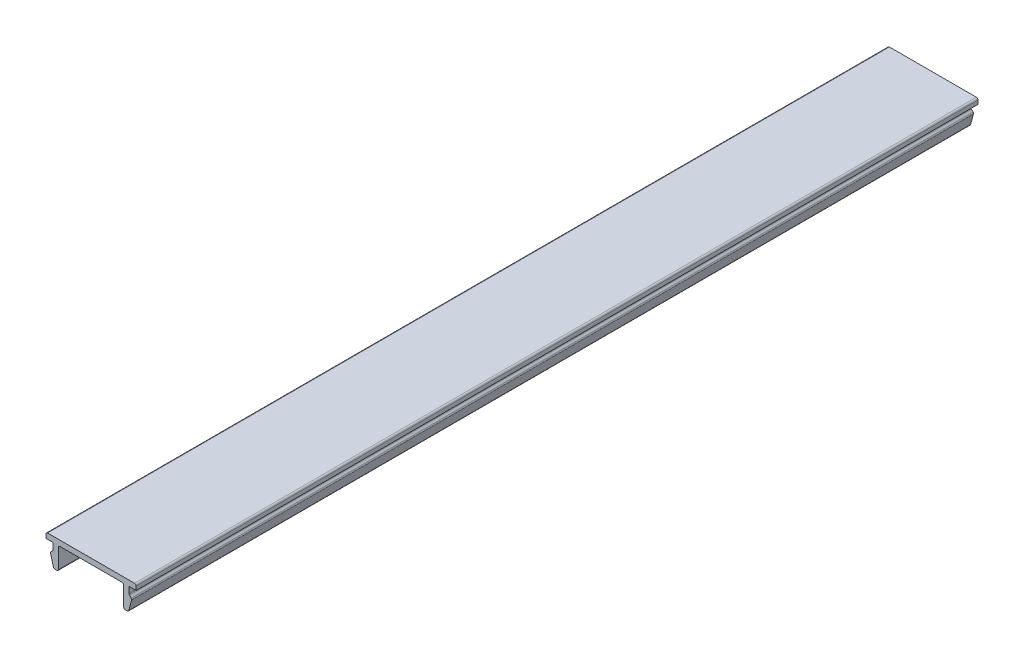
ISO-10303-21;
HEADER;
FILE_DESCRIPTION(('STEP AP214'),'2;1');
FILE_NAME('part.step','',(''),(''),'','','');
FILE_SCHEMA(('AUTOMOTIVE_DESIGN { 1 0 10303 214 1 1 1 1 }'));
ENDSEC;
DATA;
#1=APPLICATION_CONTEXT('core data for automotive mechanical design processes');
#2=APPLICATION_PROTOCOL_DEFINITION('international standard','automotive_design',2000,#1);
#3=PRODUCT_CONTEXT('',#1,'mechanical');
#4=PRODUCT('Part','Part','',(#3));
#5=PRODUCT_RELATED_PRODUCT_CATEGORY('part','',(#4));
#6=PRODUCT_DEFINITION_FORMATION('','',#4);
#7=PRODUCT_DEFINITION_CONTEXT('part definition',#1,'design');
#8=PRODUCT_DEFINITION('design','',#6,#7);
#9=PRODUCT_DEFINITION_SHAPE('','',#8);
#10=(LENGTH_UNIT() NAMED_UNIT(*) SI_UNIT(.MILLI.,.METRE.));
#11=(NAMED_UNIT(*) PLANE_ANGLE_UNIT() SI_UNIT($,.RADIAN.));
#12=(NAMED_UNIT(*) SI_UNIT($,.STERADIAN.) SOLID_ANGLE_UNIT());
#13=UNCERTAINTY_MEASURE_WITH_UNIT(LENGTH_MEASURE(1.E-05),#10,'distance_accuracy_value','');
#14=(GEOMETRIC_REPRESENTATION_CONTEXT(3) GLOBAL_UNCERTAINTY_ASSIGNED_CONTEXT((#13)) GLOBAL_UNIT_ASSIGNED_CONTEXT((#10,
#11,#12)) REPRESENTATION_CONTEXT('',''));
#15=CARTESIAN_POINT('',(0.,0.,0.));
#16=DIRECTION('',(0.,0.,1.));
#17=DIRECTION('',(1.,0.,0.));
#18=AXIS2_PLACEMENT_3D('',#15,#16,#17);
#19=CARTESIAN_POINT('',(-8.3,1.,155.));
#20=DIRECTION('',(1.,0.,0.));
#21=DIRECTION('',(0.,0.,-1.));
#22=AXIS2_PLACEMENT_3D('',#19,#20,#21);
#23=PLANE('',#22);
#24=DIRECTION('',(0.,-1.,0.));
#25=VECTOR('',#24,1.);
#26=CARTESIAN_POINT('',(-8.3,1.,155.));
#27=LINE('',#26,#25);
#28=CARTESIAN_POINT('',(-8.3,0.7,155.));
#29=VERTEX_POINT('',#28);
#30=CARTESIAN_POINT('',(-8.3,0.,155.));
#31=VERTEX_POINT('',#30);
#32=EDGE_CURVE('E224',#29,#31,#27,.T.);
#33=ORIENTED_EDGE('',*,*,#32,.F.);
#34=DIRECTION('',(0.,0.,-1.));
#35=VECTOR('',#34,1.);
#36=CARTESIAN_POINT('',(-8.3,0.7,155.));
#37=LINE('',#36,#35);
#38=CARTESIAN_POINT('',(-8.3,0.7,0.));
#39=VERTEX_POINT('',#38);
#40=EDGE_CURVE('E387',#29,#39,#37,.T.);
#41=ORIENTED_EDGE('',*,*,#40,.T.);
#42=DIRECTION('',(0.,-1.,0.));
#43=VECTOR('',#42,1.);
#44=CARTESIAN_POINT('',(-8.3,1.,0.));
#45=LINE('',#44,#43);
#46=CARTESIAN_POINT('',(-8.3,0.,0.));
#47=VERTEX_POINT('',#46);
#48=EDGE_CURVE('E252',#39,#47,#45,.T.);
#49=ORIENTED_EDGE('',*,*,#48,.T.);
#50=DIRECTION('',(0.,0.,-1.));
#51=VECTOR('',#50,1.);
#52=CARTESIAN_POINT('',(-8.3,0.,155.));
#53=LINE('',#52,#51);
#54=EDGE_CURVE('E244',#31,#47,#53,.T.);
#55=ORIENTED_EDGE('',*,*,#54,.F.);
#56=EDGE_LOOP('',(#33,#41,#49,#55));
#57=FACE_BOUND('',#56,.T.);
#58=ADVANCED_FACE('F39',(#57),#23,.F.);
#59=CARTESIAN_POINT('',(-8.3,0.,155.));
#60=DIRECTION('',(0.,1.,0.));
#61=DIRECTION('',(0.,0.,1.));
#62=AXIS2_PLACEMENT_3D('',#59,#60,#61);
#63=PLANE('',#62);
#64=DIRECTION('',(1.,0.,0.));
#65=VECTOR('',#64,1.);
#66=CARTESIAN_POINT('',(-8.3,0.,0.));
#67=LINE('',#66,#65);
#68=CARTESIAN_POINT('',(-7.,0.,0.));
#69=VERTEX_POINT('',#68);
#70=EDGE_CURVE('E422',#47,#69,#67,.T.);
#71=ORIENTED_EDGE('',*,*,#70,.T.);
#72=DIRECTION('',(0.,0.,-1.));
#73=VECTOR('',#72,1.);
#74=CARTESIAN_POINT('',(-7.,0.,155.));
#75=LINE('',#74,#73);
#76=CARTESIAN_POINT('',(-7.,0.,155.));
#77=VERTEX_POINT('',#76);
#78=EDGE_CURVE('E246',#77,#69,#75,.T.);
#79=ORIENTED_EDGE('',*,*,#78,.F.);
#80=DIRECTION('',(1.,0.,0.));
#81=VECTOR('',#80,1.);
#82=CARTESIAN_POINT('',(-8.3,0.,155.));
#83=LINE('',#82,#81);
#84=EDGE_CURVE('E229',#31,#77,#83,.T.);
#85=ORIENTED_EDGE('',*,*,#84,.F.);
#86=ORIENTED_EDGE('',*,*,#54,.T.);
#87=EDGE_LOOP('',(#71,#79,#85,#86));
#88=FACE_BOUND('',#87,.T.);
#89=ADVANCED_FACE('F243',(#88),#63,.F.);
#90=CARTESIAN_POINT('',(-7.,0.,155.));
#91=DIRECTION('',(1.,0.,0.));
#92=DIRECTION('',(0.,0.,-1.));
#93=AXIS2_PLACEMENT_3D('',#90,#91,#92);
#94=PLANE('',#93);
#95=DIRECTION('',(0.,-1.,0.));
#96=VECTOR('',#95,1.);
#97=CARTESIAN_POINT('',(-7.,0.,0.));
#98=LINE('',#97,#96);
#99=CARTESIAN_POINT('',(-7.,-1.17573593128807,0.));
#100=VERTEX_POINT('',#99);
#101=EDGE_CURVE('E413',#69,#100,#98,.T.);
#102=ORIENTED_EDGE('',*,*,#101,.T.);
#103=DIRECTION('',(0.,0.,-1.));
#104=VECTOR('',#103,1.);
#105=CARTESIAN_POINT('',(-7.,-1.17573593128807,155.));
#106=LINE('',#105,#104);
#107=CARTESIAN_POINT('',(-7.,-1.17573593128807,155.));
#108=VERTEX_POINT('',#107);
#109=EDGE_CURVE('E384',#100,#108,#106,.F.);
#110=ORIENTED_EDGE('',*,*,#109,.T.);
#111=DIRECTION('',(0.,-1.,0.));
#112=VECTOR('',#111,1.);
#113=CARTESIAN_POINT('',(-7.,0.,155.));
#114=LINE('',#113,#112);
#115=EDGE_CURVE('E249',#77,#108,#114,.T.);
#116=ORIENTED_EDGE('',*,*,#115,.F.);
#117=ORIENTED_EDGE('',*,*,#78,.T.);
#118=EDGE_LOOP('',(#102,#110,#116,#117));
#119=FACE_BOUND('',#118,.T.);
#120=ADVANCED_FACE('F420',(#119),#94,.F.);
#121=CARTESIAN_POINT('',(-7.,-1.3,155.));
#122=DIRECTION('',(0.707106781186547,-0.707106781186548,0.));
#123=DIRECTION('',(0.707106781186548,0.707106781186547,0.));
#124=AXIS2_PLACEMENT_3D('',#121,#122,#123);
#125=PLANE('',#124);
#126=DIRECTION('',(-0.707106781186548,-0.707106781186547,0.));
#127=VECTOR('',#126,1.);
#128=CARTESIAN_POINT('',(-7.,-1.3,0.));
#129=LINE('',#128,#127);
#130=CARTESIAN_POINT('',(-7.08786796564404,-1.38786796564404,0.));
#131=VERTEX_POINT('',#130);
#132=CARTESIAN_POINT('',(-7.37752551286084,-1.67752551286084,0.));
#133=VERTEX_POINT('',#132);
#134=EDGE_CURVE('E415',#131,#133,#129,.T.);
#135=ORIENTED_EDGE('',*,*,#134,.T.);
#136=DIRECTION('',(0.,0.,-1.));
#137=VECTOR('',#136,1.);
#138=CARTESIAN_POINT('',(-7.37752551286084,-1.67752551286084,155.));
#139=LINE('',#138,#137);
#140=CARTESIAN_POINT('',(-7.37752551286084,-1.67752551286084,155.));
#141=VERTEX_POINT('',#140);
#142=EDGE_CURVE('E381',#133,#141,#139,.F.);
#143=ORIENTED_EDGE('',*,*,#142,.T.);
#144=DIRECTION('',(-0.707106781186548,-0.707106781186547,0.));
#145=VECTOR('',#144,1.);
#146=CARTESIAN_POINT('',(-7.,-1.3,155.));
#147=LINE('',#146,#145);
#148=CARTESIAN_POINT('',(-7.08786796564404,-1.38786796564404,155.));
#149=VERTEX_POINT('',#148);
#150=EDGE_CURVE('E428',#149,#141,#147,.T.);
#151=ORIENTED_EDGE('',*,*,#150,.F.);
#152=DIRECTION('',(0.,0.,-1.));
#153=VECTOR('',#152,1.);
#154=CARTESIAN_POINT('',(-7.08786796564404,-1.38786796564404,0.));
#155=LINE('',#154,#153);
#156=EDGE_CURVE('E377',#149,#131,#155,.T.);
#157=ORIENTED_EDGE('',*,*,#156,.T.);
#158=EDGE_LOOP('',(#135,#143,#151,#157));
#159=FACE_BOUND('',#158,.T.);
#160=ADVANCED_FACE('F431',(#159),#125,.F.);
#161=CARTESIAN_POINT('',(-7.5,-1.8,155.));
#162=DIRECTION('',(0.965925826289068,0.258819045102522,0.));
#163=DIRECTION('',(-0.258819045102522,0.965925826289068,0.));
#164=AXIS2_PLACEMENT_3D('',#161,#162,#163);
#165=PLANE('',#164);
#166=DIRECTION('',(0.258819045102522,-0.965925826289068,0.));
#167=VECTOR('',#166,1.);
#168=CARTESIAN_POINT('',(-7.5,-1.8,0.));
#169=LINE('',#168,#167);
#170=CARTESIAN_POINT('',(-7.4551712263916,-1.96730326074756,0.));
#171=VERTEX_POINT('',#170);
#172=CARTESIAN_POINT('',(-6.94329650890145,-3.87764571353076,0.));
#173=VERTEX_POINT('',#172);
#174=EDGE_CURVE('E488',#171,#173,#169,.T.);
#175=ORIENTED_EDGE('',*,*,#174,.T.);
#176=DIRECTION('',(0.,0.,-1.));
#177=VECTOR('',#176,1.);
#178=CARTESIAN_POINT('',(-6.94329650890145,-3.87764571353076,155.));
#179=LINE('',#178,#177);
#180=CARTESIAN_POINT('',(-6.94329650890145,-3.87764571353076,155.));
#181=VERTEX_POINT('',#180);
#182=EDGE_CURVE('E374',#173,#181,#179,.F.);
#183=ORIENTED_EDGE('',*,*,#182,.T.);
#184=DIRECTION('',(0.258819045102522,-0.965925826289068,0.));
#185=VECTOR('',#184,1.);
#186=CARTESIAN_POINT('',(-7.5,-1.8,155.));
#187=LINE('',#186,#185);
#188=CARTESIAN_POINT('',(-7.4551712263916,-1.96730326074756,155.));
#189=VERTEX_POINT('',#188);
#190=EDGE_CURVE('E434',#189,#181,#187,.T.);
#191=ORIENTED_EDGE('',*,*,#190,.F.);
#192=DIRECTION('',(0.,0.,-1.));
#193=VECTOR('',#192,1.);
#194=CARTESIAN_POINT('',(-7.4551712263916,-1.96730326074756,155.));
#195=LINE('',#194,#193);
#196=EDGE_CURVE('E370',#189,#171,#195,.T.);
#197=ORIENTED_EDGE('',*,*,#196,.T.);
#198=EDGE_LOOP('',(#175,#183,#191,#197));
#199=FACE_BOUND('',#198,.T.);
#200=ADVANCED_FACE('F613',(#199),#165,.F.);
#201=CARTESIAN_POINT('',(-6.,-4.1,155.));
#202=DIRECTION('',(0.,1.,0.));
#203=DIRECTION('',(0.,0.,1.));
#204=AXIS2_PLACEMENT_3D('',#201,#202,#203);
#205=PLANE('',#204);
#206=DIRECTION('',(1.,0.,0.));
#207=VECTOR('',#206,1.);
#208=CARTESIAN_POINT('',(-6.,-4.1,0.));
#209=LINE('',#208,#207);
#210=CARTESIAN_POINT('',(-6.65351876101473,-4.1,0.));
#211=VERTEX_POINT('',#210);
#212=CARTESIAN_POINT('',(-6.3,-4.1,0.));
#213=VERTEX_POINT('',#212);
#214=EDGE_CURVE('E492',#211,#213,#209,.T.);
#215=ORIENTED_EDGE('',*,*,#214,.T.);
#216=DIRECTION('',(0.,0.,-1.));
#217=VECTOR('',#216,1.);
#218=CARTESIAN_POINT('',(-6.3,-4.1,155.));
#219=LINE('',#218,#217);
#220=CARTESIAN_POINT('',(-6.3,-4.1,155.));
#221=VERTEX_POINT('',#220);
#222=EDGE_CURVE('E367',#213,#221,#219,.F.);
#223=ORIENTED_EDGE('',*,*,#222,.T.);
#224=DIRECTION('',(1.,0.,0.));
#225=VECTOR('',#224,1.);
#226=CARTESIAN_POINT('',(-6.,-4.1,155.));
#227=LINE('',#226,#225);
#228=CARTESIAN_POINT('',(-6.65351876101473,-4.1,155.));
#229=VERTEX_POINT('',#228);
#230=EDGE_CURVE('E439',#229,#221,#227,.T.);
#231=ORIENTED_EDGE('',*,*,#230,.F.);
#232=DIRECTION('',(0.,0.,-1.));
#233=VECTOR('',#232,1.);
#234=CARTESIAN_POINT('',(-6.65351876101473,-4.1,155.));
#235=LINE('',#234,#233);
#236=EDGE_CURVE('E363',#229,#211,#235,.T.);
#237=ORIENTED_EDGE('',*,*,#236,.T.);
#238=EDGE_LOOP('',(#215,#223,#231,#237));
#239=FACE_BOUND('',#238,.T.);
#240=ADVANCED_FACE('F620',(#239),#205,.F.);
#241=CARTESIAN_POINT('',(-6.,0.,155.));
#242=DIRECTION('',(-1.,0.,0.));
#243=DIRECTION('',(0.,-1.,0.));
#244=AXIS2_PLACEMENT_3D('',#241,#242,#243);
#245=PLANE('',#244);
#246=DIRECTION('',(0.,1.,0.));
#247=VECTOR('',#246,1.);
#248=CARTESIAN_POINT('',(-6.,0.,0.));
#249=LINE('',#248,#247);
#250=CARTESIAN_POINT('',(-6.,-3.8,0.));
#251=VERTEX_POINT('',#250);
#252=CARTESIAN_POINT('',(-6.,-0.3,0.));
#253=VERTEX_POINT('',#252);
#254=EDGE_CURVE('E496',#251,#253,#249,.T.);
#255=ORIENTED_EDGE('',*,*,#254,.T.);
#256=DIRECTION('',(0.,0.,-1.));
#257=VECTOR('',#256,1.);
#258=CARTESIAN_POINT('',(-6.,-0.3,155.));
#259=LINE('',#258,#257);
#260=CARTESIAN_POINT('',(-6.,-0.3,155.));
#261=VERTEX_POINT('',#260);
#262=EDGE_CURVE('E360',#253,#261,#259,.F.);
#263=ORIENTED_EDGE('',*,*,#262,.T.);
#264=DIRECTION('',(0.,1.,0.));
#265=VECTOR('',#264,1.);
#266=CARTESIAN_POINT('',(-6.,0.,155.));
#267=LINE('',#266,#265);
#268=CARTESIAN_POINT('',(-6.,-3.8,155.));
#269=VERTEX_POINT('',#268);
#270=EDGE_CURVE('E446',#269,#261,#267,.T.);
#271=ORIENTED_EDGE('',*,*,#270,.F.);
#272=DIRECTION('',(0.,0.,-1.));
#273=VECTOR('',#272,1.);
#274=CARTESIAN_POINT('',(-6.,-3.8,155.));
#275=LINE('',#274,#273);
#276=EDGE_CURVE('E356',#269,#251,#275,.T.);
#277=ORIENTED_EDGE('',*,*,#276,.T.);
#278=EDGE_LOOP('',(#255,#263,#271,#277));
#279=FACE_BOUND('',#278,.T.);
#280=ADVANCED_FACE('F627',(#279),#245,.F.);
#281=CARTESIAN_POINT('',(-6.,0.,155.));
#282=DIRECTION('',(0.,1.,0.));
#283=DIRECTION('',(0.,0.,1.));
#284=AXIS2_PLACEMENT_3D('',#281,#282,#283);
#285=PLANE('',#284);
#286=DIRECTION('',(1.,0.,0.));
#287=VECTOR('',#286,1.);
#288=CARTESIAN_POINT('',(-6.,0.,0.));
#289=LINE('',#288,#287);
#290=CARTESIAN_POINT('',(-5.7,0.,0.));
#291=VERTEX_POINT('',#290);
#292=CARTESIAN_POINT('',(5.69999999999999,0.,0.));
#293=VERTEX_POINT('',#292);
#294=EDGE_CURVE('E500',#291,#293,#289,.T.);
#295=ORIENTED_EDGE('',*,*,#294,.T.);
#296=DIRECTION('',(0.,0.,-1.));
#297=VECTOR('',#296,1.);
#298=CARTESIAN_POINT('',(5.69999999999999,0.,155.));
#299=LINE('',#298,#297);
#300=CARTESIAN_POINT('',(5.69999999999999,0.,155.));
#301=VERTEX_POINT('',#300);
#302=EDGE_CURVE('E353',#293,#301,#299,.F.);
#303=ORIENTED_EDGE('',*,*,#302,.T.);
#304=DIRECTION('',(1.,0.,0.));
#305=VECTOR('',#304,1.);
#306=CARTESIAN_POINT('',(-6.,0.,155.));
#307=LINE('',#306,#305);
#308=CARTESIAN_POINT('',(-5.7,0.,155.));
#309=VERTEX_POINT('',#308);
#310=EDGE_CURVE('E450',#309,#301,#307,.T.);
#311=ORIENTED_EDGE('',*,*,#310,.F.);
#312=DIRECTION('',(0.,0.,-1.));
#313=VECTOR('',#312,1.);
#314=CARTESIAN_POINT('',(-5.7,0.,0.));
#315=LINE('',#314,#313);
#316=EDGE_CURVE('E349',#309,#291,#315,.T.);
#317=ORIENTED_EDGE('',*,*,#316,.T.);
#318=EDGE_LOOP('',(#295,#303,#311,#317));
#319=FACE_BOUND('',#318,.T.);
#320=ADVANCED_FACE('F634',(#319),#285,.F.);
#321=CARTESIAN_POINT('',(5.99999999999999,0.,155.));
#322=DIRECTION('',(1.,0.,0.));
#323=DIRECTION('',(0.,1.,0.));
#324=AXIS2_PLACEMENT_3D('',#321,#322,#323);
#325=PLANE('',#324);
#326=DIRECTION('',(0.,-1.,0.));
#327=VECTOR('',#326,1.);
#328=CARTESIAN_POINT('',(5.99999999999999,0.,0.));
#329=LINE('',#328,#327);
#330=CARTESIAN_POINT('',(5.99999999999999,-0.3,0.));
#331=VERTEX_POINT('',#330);
#332=CARTESIAN_POINT('',(5.99999999999999,-3.8,0.));
#333=VERTEX_POINT('',#332);
#334=EDGE_CURVE('E504',#331,#333,#329,.T.);
#335=ORIENTED_EDGE('',*,*,#334,.T.);
#336=DIRECTION('',(0.,0.,-1.));
#337=VECTOR('',#336,1.);
#338=CARTESIAN_POINT('',(5.99999999999999,-3.8,155.));
#339=LINE('',#338,#337);
#340=CARTESIAN_POINT('',(5.99999999999999,-3.8,155.));
#341=VERTEX_POINT('',#340);
#342=EDGE_CURVE('E346',#333,#341,#339,.F.);
#343=ORIENTED_EDGE('',*,*,#342,.T.);
#344=DIRECTION('',(0.,-1.,0.));
#345=VECTOR('',#344,1.);
#346=CARTESIAN_POINT('',(5.99999999999999,0.,155.));
#347=LINE('',#346,#345);
#348=CARTESIAN_POINT('',(5.99999999999999,-0.3,155.));
#349=VERTEX_POINT('',#348);
#350=EDGE_CURVE('E454',#349,#341,#347,.T.);
#351=ORIENTED_EDGE('',*,*,#350,.F.);
#352=DIRECTION('',(0.,0.,-1.));
#353=VECTOR('',#352,1.);
#354=CARTESIAN_POINT('',(5.99999999999999,-0.3,0.));
#355=LINE('',#354,#353);
#356=EDGE_CURVE('E342',#349,#331,#355,.T.);
#357=ORIENTED_EDGE('',*,*,#356,.T.);
#358=EDGE_LOOP('',(#335,#343,#351,#357));
#359=FACE_BOUND('',#358,.T.);
#360=ADVANCED_FACE('F641',(#359),#325,.F.);
#361=CARTESIAN_POINT('',(5.99999999999999,-4.1,155.));
#362=DIRECTION('',(0.,1.,0.));
#363=DIRECTION('',(0.,0.,1.));
#364=AXIS2_PLACEMENT_3D('',#361,#362,#363);
#365=PLANE('',#364);
#366=DIRECTION('',(1.,0.,0.));
#367=VECTOR('',#366,1.);
#368=CARTESIAN_POINT('',(5.99999999999999,-4.1,0.));
#369=LINE('',#368,#367);
#370=CARTESIAN_POINT('',(6.29999999999999,-4.1,0.));
#371=VERTEX_POINT('',#370);
#372=CARTESIAN_POINT('',(6.65351876101472,-4.1,0.));
#373=VERTEX_POINT('',#372);
#374=EDGE_CURVE('E508',#371,#373,#369,.T.);
#375=ORIENTED_EDGE('',*,*,#374,.T.);
#376=DIRECTION('',(0.,0.,-1.));
#377=VECTOR('',#376,1.);
#378=CARTESIAN_POINT('',(6.65351876101472,-4.1,155.));
#379=LINE('',#378,#377);
#380=CARTESIAN_POINT('',(6.65351876101472,-4.1,155.));
#381=VERTEX_POINT('',#380);
#382=EDGE_CURVE('E339',#373,#381,#379,.F.);
#383=ORIENTED_EDGE('',*,*,#382,.T.);
#384=DIRECTION('',(1.,0.,0.));
#385=VECTOR('',#384,1.);
#386=CARTESIAN_POINT('',(5.99999999999999,-4.1,155.));
#387=LINE('',#386,#385);
#388=CARTESIAN_POINT('',(6.29999999999999,-4.1,155.));
#389=VERTEX_POINT('',#388);
#390=EDGE_CURVE('E458',#389,#381,#387,.T.);
#391=ORIENTED_EDGE('',*,*,#390,.F.);
#392=DIRECTION('',(0.,0.,-1.));
#393=VECTOR('',#392,1.);
#394=CARTESIAN_POINT('',(6.29999999999999,-4.1,155.));
#395=LINE('',#394,#393);
#396=EDGE_CURVE('E335',#389,#371,#395,.T.);
#397=ORIENTED_EDGE('',*,*,#396,.T.);
#398=EDGE_LOOP('',(#375,#383,#391,#397));
#399=FACE_BOUND('',#398,.T.);
#400=ADVANCED_FACE('F648',(#399),#365,.F.);
#401=CARTESIAN_POINT('',(7.49999999999999,-1.8,155.));
#402=DIRECTION('',(-0.965925826289068,0.258819045102522,0.));
#403=DIRECTION('',(-0.258819045102522,-0.965925826289068,0.));
#404=AXIS2_PLACEMENT_3D('',#401,#402,#403);
#405=PLANE('',#404);
#406=DIRECTION('',(0.258819045102522,0.965925826289068,0.));
#407=VECTOR('',#406,1.);
#408=CARTESIAN_POINT('',(7.49999999999999,-1.8,0.));
#409=LINE('',#408,#407);
#410=CARTESIAN_POINT('',(6.94329650890144,-3.87764571353075,0.));
#411=VERTEX_POINT('',#410);
#412=CARTESIAN_POINT('',(7.45517122639159,-1.96730326074756,0.));
#413=VERTEX_POINT('',#412);
#414=EDGE_CURVE('E512',#411,#413,#409,.T.);
#415=ORIENTED_EDGE('',*,*,#414,.T.);
#416=DIRECTION('',(0.,0.,-1.));
#417=VECTOR('',#416,1.);
#418=CARTESIAN_POINT('',(7.45517122639159,-1.96730326074756,155.));
#419=LINE('',#418,#417);
#420=CARTESIAN_POINT('',(7.45517122639159,-1.96730326074756,155.));
#421=VERTEX_POINT('',#420);
#422=EDGE_CURVE('E332',#413,#421,#419,.F.);
#423=ORIENTED_EDGE('',*,*,#422,.T.);
#424=DIRECTION('',(0.258819045102522,0.965925826289068,0.));
#425=VECTOR('',#424,1.);
#426=CARTESIAN_POINT('',(7.49999999999999,-1.8,155.));
#427=LINE('',#426,#425);
#428=CARTESIAN_POINT('',(6.94329650890144,-3.87764571353075,155.));
#429=VERTEX_POINT('',#428);
#430=EDGE_CURVE('E462',#429,#421,#427,.T.);
#431=ORIENTED_EDGE('',*,*,#430,.F.);
#432=DIRECTION('',(0.,0.,-1.));
#433=VECTOR('',#432,1.);
#434=CARTESIAN_POINT('',(6.94329650890144,-3.87764571353075,155.));
#435=LINE('',#434,#433);
#436=EDGE_CURVE('E328',#429,#411,#435,.T.);
#437=ORIENTED_EDGE('',*,*,#436,.T.);
#438=EDGE_LOOP('',(#415,#423,#431,#437));
#439=FACE_BOUND('',#438,.T.);
#440=ADVANCED_FACE('F655',(#439),#405,.F.);
#441=CARTESIAN_POINT('',(6.99999999999999,-1.3,155.));
#442=DIRECTION('',(-0.707106781186547,-0.707106781186548,0.));
#443=DIRECTION('',(0.707106781186548,-0.707106781186547,0.));
#444=AXIS2_PLACEMENT_3D('',#441,#442,#443);
#445=PLANE('',#444);
#446=DIRECTION('',(-0.707106781186548,0.707106781186547,0.));
#447=VECTOR('',#446,1.);
#448=CARTESIAN_POINT('',(6.99999999999999,-1.3,0.));
#449=LINE('',#448,#447);
#450=CARTESIAN_POINT('',(7.37752551286083,-1.67752551286084,0.));
#451=VERTEX_POINT('',#450);
#452=CARTESIAN_POINT('',(7.08786796564403,-1.38786796564403,0.));
#453=VERTEX_POINT('',#452);
#454=EDGE_CURVE('E516',#451,#453,#449,.T.);
#455=ORIENTED_EDGE('',*,*,#454,.T.);
#456=DIRECTION('',(0.,0.,-1.));
#457=VECTOR('',#456,1.);
#458=CARTESIAN_POINT('',(7.08786796564403,-1.38786796564403,155.));
#459=LINE('',#458,#457);
#460=CARTESIAN_POINT('',(7.08786796564403,-1.38786796564403,155.));
#461=VERTEX_POINT('',#460);
#462=EDGE_CURVE('E63',#453,#461,#459,.F.);
#463=ORIENTED_EDGE('',*,*,#462,.T.);
#464=DIRECTION('',(-0.707106781186548,0.707106781186547,0.));
#465=VECTOR('',#464,1.);
#466=CARTESIAN_POINT('',(6.99999999999999,-1.3,155.));
#467=LINE('',#466,#465);
#468=CARTESIAN_POINT('',(7.37752551286083,-1.67752551286084,155.));
#469=VERTEX_POINT('',#468);
#470=EDGE_CURVE('E466',#469,#461,#467,.T.);
#471=ORIENTED_EDGE('',*,*,#470,.F.);
#472=DIRECTION('',(0.,0.,-1.));
#473=VECTOR('',#472,1.);
#474=CARTESIAN_POINT('',(7.37752551286083,-1.67752551286084,155.));
#475=LINE('',#474,#473);
#476=EDGE_CURVE('E322',#469,#451,#475,.T.);
#477=ORIENTED_EDGE('',*,*,#476,.T.);
#478=EDGE_LOOP('',(#455,#463,#471,#477));
#479=FACE_BOUND('',#478,.T.);
#480=ADVANCED_FACE('F659',(#479),#445,.F.);
#481=CARTESIAN_POINT('',(6.99999999999999,0.,155.));
#482=DIRECTION('',(-1.,0.,0.));
#483=DIRECTION('',(0.,0.,1.));
#484=AXIS2_PLACEMENT_3D('',#481,#482,#483);
#485=PLANE('',#484);
#486=DIRECTION('',(0.,1.,0.));
#487=VECTOR('',#486,1.);
#488=CARTESIAN_POINT('',(6.99999999999999,0.,155.));
#489=LINE('',#488,#487);
#490=CARTESIAN_POINT('',(6.99999999999999,-1.17573593128807,155.));
#491=VERTEX_POINT('',#490);
#492=CARTESIAN_POINT('',(6.99999999999999,0.,155.));
#493=VERTEX_POINT('',#492);
#494=EDGE_CURVE('E469',#491,#493,#489,.T.);
#495=ORIENTED_EDGE('',*,*,#494,.F.);
#496=DIRECTION('',(0.,0.,-1.));
#497=VECTOR('',#496,1.);
#498=CARTESIAN_POINT('',(6.99999999999999,-1.17573593128807,0.));
#499=LINE('',#498,#497);
#500=CARTESIAN_POINT('',(6.99999999999999,-1.17573593128807,0.));
#501=VERTEX_POINT('',#500);
#502=EDGE_CURVE('E318',#491,#501,#499,.T.);
#503=ORIENTED_EDGE('',*,*,#502,.T.);
#504=DIRECTION('',(0.,1.,0.));
#505=VECTOR('',#504,1.);
#506=CARTESIAN_POINT('',(6.99999999999999,0.,0.));
#507=LINE('',#506,#505);
#508=CARTESIAN_POINT('',(6.99999999999999,0.,0.));
#509=VERTEX_POINT('',#508);
#510=EDGE_CURVE('E519',#501,#509,#507,.T.);
#511=ORIENTED_EDGE('',*,*,#510,.T.);
#512=DIRECTION('',(0.,0.,-1.));
#513=VECTOR('',#512,1.);
#514=CARTESIAN_POINT('',(6.99999999999999,0.,155.));
#515=LINE('',#514,#513);
#516=EDGE_CURVE('E261',#493,#509,#515,.T.);
#517=ORIENTED_EDGE('',*,*,#516,.F.);
#518=EDGE_LOOP('',(#495,#503,#511,#517));
#519=FACE_BOUND('',#518,.T.);
#520=ADVANCED_FACE('F662',(#519),#485,.F.);
#521=CARTESIAN_POINT('',(6.99999999999999,0.,155.));
#522=DIRECTION('',(0.,1.,0.));
#523=DIRECTION('',(0.,0.,1.));
#524=AXIS2_PLACEMENT_3D('',#521,#522,#523);
#525=PLANE('',#524);
#526=DIRECTION('',(1.,0.,0.));
#527=VECTOR('',#526,1.);
#528=CARTESIAN_POINT('',(6.99999999999999,0.,0.));
#529=LINE('',#528,#527);
#530=CARTESIAN_POINT('',(8.3,0.,0.));
#531=VERTEX_POINT('',#530);
#532=EDGE_CURVE('E522',#509,#531,#529,.T.);
#533=ORIENTED_EDGE('',*,*,#532,.T.);
#534=DIRECTION('',(0.,0.,-1.));
#535=VECTOR('',#534,1.);
#536=CARTESIAN_POINT('',(8.3,0.,155.));
#537=LINE('',#536,#535);
#538=CARTESIAN_POINT('',(8.3,0.,155.));
#539=VERTEX_POINT('',#538);
#540=EDGE_CURVE('E481',#539,#531,#537,.T.);
#541=ORIENTED_EDGE('',*,*,#540,.F.);
#542=DIRECTION('',(1.,0.,0.));
#543=VECTOR('',#542,1.);
#544=CARTESIAN_POINT('',(6.99999999999999,0.,155.));
#545=LINE('',#544,#543);
#546=EDGE_CURVE('E472',#493,#539,#545,.T.);
#547=ORIENTED_EDGE('',*,*,#546,.F.);
#548=ORIENTED_EDGE('',*,*,#516,.T.);
#549=EDGE_LOOP('',(#533,#541,#547,#548));
#550=FACE_BOUND('',#549,.T.);
#551=ADVANCED_FACE('F540',(#550),#525,.F.);
#552=CARTESIAN_POINT('',(8.3,1.,155.));
#553=DIRECTION('',(-1.,0.,0.));
#554=DIRECTION('',(0.,0.,1.));
#555=AXIS2_PLACEMENT_3D('',#552,#553,#554);
#556=PLANE('',#555);
#557=DIRECTION('',(0.,1.,0.));
#558=VECTOR('',#557,1.);
#559=CARTESIAN_POINT('',(8.3,1.,0.));
#560=LINE('',#559,#558);
#561=CARTESIAN_POINT('',(8.3,0.700000000000004,0.));
#562=VERTEX_POINT('',#561);
#563=EDGE_CURVE('E525',#531,#562,#560,.T.);
#564=ORIENTED_EDGE('',*,*,#563,.T.);
#565=DIRECTION('',(0.,0.,-1.));
#566=VECTOR('',#565,1.);
#567=CARTESIAN_POINT('',(8.3,0.700000000000004,155.));
#568=LINE('',#567,#566);
#569=CARTESIAN_POINT('',(8.3,0.700000000000004,155.));
#570=VERTEX_POINT('',#569);
#571=EDGE_CURVE('E292',#562,#570,#568,.F.);
#572=ORIENTED_EDGE('',*,*,#571,.T.);
#573=DIRECTION('',(0.,1.,0.));
#574=VECTOR('',#573,1.);
#575=CARTESIAN_POINT('',(8.3,1.,155.));
#576=LINE('',#575,#574);
#577=EDGE_CURVE('E475',#539,#570,#576,.T.);
#578=ORIENTED_EDGE('',*,*,#577,.F.);
#579=ORIENTED_EDGE('',*,*,#540,.T.);
#580=EDGE_LOOP('',(#564,#572,#578,#579));
#581=FACE_BOUND('',#580,.T.);
#582=ADVANCED_FACE('F547',(#581),#556,.F.);
#583=CARTESIAN_POINT('',(-8.3,1.,155.));
#584=DIRECTION('',(0.,-1.,0.));
#585=DIRECTION('',(1.,0.,0.));
#586=AXIS2_PLACEMENT_3D('',#583,#584,#585);
#587=PLANE('',#586);
#588=DIRECTION('',(-1.,0.,0.));
#589=VECTOR('',#588,1.);
#590=CARTESIAN_POINT('',(-8.3,1.,155.));
#591=LINE('',#590,#589);
#592=CARTESIAN_POINT('',(7.99999999999999,1.,155.));
#593=VERTEX_POINT('',#592);
#594=CARTESIAN_POINT('',(-8.,1.,155.));
#595=VERTEX_POINT('',#594);
#596=EDGE_CURVE('E478',#593,#595,#591,.T.);
#597=ORIENTED_EDGE('',*,*,#596,.F.);
#598=DIRECTION('',(0.,0.,-1.));
#599=VECTOR('',#598,1.);
#600=CARTESIAN_POINT('',(8.,1.,155.));
#601=LINE('',#600,#599);
#602=CARTESIAN_POINT('',(7.99999999999999,1.,0.));
#603=VERTEX_POINT('',#602);
#604=EDGE_CURVE('E259',#593,#603,#601,.T.);
#605=ORIENTED_EDGE('',*,*,#604,.T.);
#606=DIRECTION('',(-1.,0.,0.));
#607=VECTOR('',#606,1.);
#608=CARTESIAN_POINT('',(-8.3,1.,0.));
#609=LINE('',#608,#607);
#610=CARTESIAN_POINT('',(-8.,1.,0.));
#611=VERTEX_POINT('',#610);
#612=EDGE_CURVE('E239',#603,#611,#609,.T.);
#613=ORIENTED_EDGE('',*,*,#612,.T.);
#614=DIRECTION('',(0.,0.,-1.));
#615=VECTOR('',#614,1.);
#616=CARTESIAN_POINT('',(-8.,1.,155.));
#617=LINE('',#616,#615);
#618=EDGE_CURVE('E255',#611,#595,#617,.F.);
#619=ORIENTED_EDGE('',*,*,#618,.T.);
#620=EDGE_LOOP('',(#597,#605,#613,#619));
#621=FACE_BOUND('',#620,.T.);
#622=ADVANCED_FACE('F555',(#621),#587,.F.);
#623=CARTESIAN_POINT('',(0.,0.,155.));
#624=DIRECTION('',(0.,0.,1.));
#625=DIRECTION('',(1.,0.,0.));
#626=AXIS2_PLACEMENT_3D('',#623,#624,#625);
#627=PLANE('',#626);
#628=ORIENTED_EDGE('',*,*,#577,.T.);
#629=CARTESIAN_POINT('',(8.,0.700000000000004,155.));
#630=DIRECTION('',(0.,0.,1.));
#631=DIRECTION('',(1.,0.,0.));
#632=AXIS2_PLACEMENT_3D('',#629,#630,#631);
#633=CIRCLE('',#632,0.3);
#634=EDGE_CURVE('E315',#570,#593,#633,.T.);
#635=ORIENTED_EDGE('',*,*,#634,.T.);
#636=ORIENTED_EDGE('',*,*,#596,.T.);
#637=CARTESIAN_POINT('',(-8.,0.7,155.));
#638=DIRECTION('',(0.,0.,1.));
#639=DIRECTION('',(1.,0.,0.));
#640=AXIS2_PLACEMENT_3D('',#637,#638,#639);
#641=CIRCLE('',#640,0.3);
#642=EDGE_CURVE('E233',#595,#29,#641,.T.);
#643=ORIENTED_EDGE('',*,*,#642,.T.);
#644=ORIENTED_EDGE('',*,*,#32,.T.);
#645=ORIENTED_EDGE('',*,*,#84,.T.);
#646=ORIENTED_EDGE('',*,*,#115,.T.);
#647=CARTESIAN_POINT('',(-7.3,-1.17573593128807,155.));
#648=DIRECTION('',(0.,0.,1.));
#649=DIRECTION('',(1.,0.,0.));
#650=AXIS2_PLACEMENT_3D('',#647,#648,#649);
#651=CIRCLE('',#650,0.3);
#652=EDGE_CURVE('E11',#108,#149,#651,.F.);
#653=ORIENTED_EDGE('',*,*,#652,.T.);
#654=ORIENTED_EDGE('',*,*,#150,.T.);
#655=CARTESIAN_POINT('',(-7.16539347850488,-1.8896575472168,155.));
#656=DIRECTION('',(0.,0.,1.));
#657=DIRECTION('',(1.,0.,0.));
#658=AXIS2_PLACEMENT_3D('',#655,#656,#657);
#659=CIRCLE('',#658,0.3);
#660=EDGE_CURVE('E297',#141,#189,#659,.T.);
#661=ORIENTED_EDGE('',*,*,#660,.T.);
#662=ORIENTED_EDGE('',*,*,#190,.T.);
#663=CARTESIAN_POINT('',(-6.65351876101473,-3.8,155.));
#664=DIRECTION('',(0.,0.,1.));
#665=DIRECTION('',(1.,0.,0.));
#666=AXIS2_PLACEMENT_3D('',#663,#664,#665);
#667=CIRCLE('',#666,0.3);
#668=EDGE_CURVE('E300',#181,#229,#667,.T.);
#669=ORIENTED_EDGE('',*,*,#668,.T.);
#670=ORIENTED_EDGE('',*,*,#230,.T.);
#671=CARTESIAN_POINT('',(-6.3,-3.8,155.));
#672=DIRECTION('',(0.,0.,1.));
#673=DIRECTION('',(1.,0.,0.));
#674=AXIS2_PLACEMENT_3D('',#671,#672,#673);
#675=CIRCLE('',#674,0.3);
#676=EDGE_CURVE('E303',#221,#269,#675,.T.);
#677=ORIENTED_EDGE('',*,*,#676,.T.);
#678=ORIENTED_EDGE('',*,*,#270,.T.);
#679=CARTESIAN_POINT('',(-5.7,-0.3,155.));
#680=DIRECTION('',(0.,0.,1.));
#681=DIRECTION('',(1.,0.,0.));
#682=AXIS2_PLACEMENT_3D('',#679,#680,#681);
#683=CIRCLE('',#682,0.3);
#684=EDGE_CURVE('E404',#261,#309,#683,.F.);
#685=ORIENTED_EDGE('',*,*,#684,.T.);
#686=ORIENTED_EDGE('',*,*,#310,.T.);
#687=CARTESIAN_POINT('',(5.69999999999999,-0.3,155.));
#688=DIRECTION('',(0.,0.,1.));
#689=DIRECTION('',(1.,0.,0.));
#690=AXIS2_PLACEMENT_3D('',#687,#688,#689);
#691=CIRCLE('',#690,0.3);
#692=EDGE_CURVE('E398',#301,#349,#691,.F.);
#693=ORIENTED_EDGE('',*,*,#692,.T.);
#694=ORIENTED_EDGE('',*,*,#350,.T.);
#695=CARTESIAN_POINT('',(6.29999999999999,-3.8,155.));
#696=DIRECTION('',(0.,0.,1.));
#697=DIRECTION('',(1.,0.,0.));
#698=AXIS2_PLACEMENT_3D('',#695,#696,#697);
#699=CIRCLE('',#698,0.3);
#700=EDGE_CURVE('E306',#341,#389,#699,.T.);
#701=ORIENTED_EDGE('',*,*,#700,.T.);
#702=ORIENTED_EDGE('',*,*,#390,.T.);
#703=CARTESIAN_POINT('',(6.65351876101472,-3.8,155.));
#704=DIRECTION('',(0.,0.,1.));
#705=DIRECTION('',(1.,0.,0.));
#706=AXIS2_PLACEMENT_3D('',#703,#704,#705);
#707=CIRCLE('',#706,0.3);
#708=EDGE_CURVE('E309',#381,#429,#707,.T.);
#709=ORIENTED_EDGE('',*,*,#708,.T.);
#710=ORIENTED_EDGE('',*,*,#430,.T.);
#711=CARTESIAN_POINT('',(7.16539347850487,-1.8896575472168,155.));
#712=DIRECTION('',(0.,0.,1.));
#713=DIRECTION('',(1.,0.,0.));
#714=AXIS2_PLACEMENT_3D('',#711,#712,#713);
#715=CIRCLE('',#714,0.3);
#716=EDGE_CURVE('E312',#421,#469,#715,.T.);
#717=ORIENTED_EDGE('',*,*,#716,.T.);
#718=ORIENTED_EDGE('',*,*,#470,.T.);
#719=CARTESIAN_POINT('',(7.29999999999999,-1.17573593128807,155.));
#720=DIRECTION('',(0.,0.,1.));
#721=DIRECTION('',(1.,0.,0.));
#722=AXIS2_PLACEMENT_3D('',#719,#720,#721);
#723=CIRCLE('',#722,0.3);
#724=EDGE_CURVE('E55',#461,#491,#723,.F.);
#725=ORIENTED_EDGE('',*,*,#724,.T.);
#726=ORIENTED_EDGE('',*,*,#494,.T.);
#727=ORIENTED_EDGE('',*,*,#546,.T.);
#728=EDGE_LOOP('',(#628,#635,#636,#643,#644,#645,#646,#653,#654,#661,#662,#669,#670,#677,#678,
#685,#686,#693,#694,#701,#702,#709,#710,#717,#718,#725,#726,#727));
#729=FACE_BOUND('',#728,.T.);
#730=ADVANCED_FACE('F227',(#729),#627,.T.);
#731=CARTESIAN_POINT('',(0.,0.,0.));
#732=DIRECTION('',(0.,0.,1.));
#733=DIRECTION('',(1.,0.,0.));
#734=AXIS2_PLACEMENT_3D('',#731,#732,#733);
#735=PLANE('',#734);
#736=ORIENTED_EDGE('',*,*,#612,.F.);
#737=CARTESIAN_POINT('',(8.,0.700000000000004,0.));
#738=DIRECTION('',(0.,0.,1.));
#739=DIRECTION('',(1.,0.,0.));
#740=AXIS2_PLACEMENT_3D('',#737,#738,#739);
#741=CIRCLE('',#740,0.3);
#742=EDGE_CURVE('E289',#603,#562,#741,.F.);
#743=ORIENTED_EDGE('',*,*,#742,.T.);
#744=ORIENTED_EDGE('',*,*,#563,.F.);
#745=ORIENTED_EDGE('',*,*,#532,.F.);
#746=ORIENTED_EDGE('',*,*,#510,.F.);
#747=CARTESIAN_POINT('',(7.29999999999999,-1.17573593128807,0.));
#748=DIRECTION('',(0.,0.,1.));
#749=DIRECTION('',(1.,0.,0.));
#750=AXIS2_PLACEMENT_3D('',#747,#748,#749);
#751=CIRCLE('',#750,0.3);
#752=EDGE_CURVE('E390',#501,#453,#751,.T.);
#753=ORIENTED_EDGE('',*,*,#752,.T.);
#754=ORIENTED_EDGE('',*,*,#454,.F.);
#755=CARTESIAN_POINT('',(7.16539347850487,-1.8896575472168,0.));
#756=DIRECTION('',(0.,0.,1.));
#757=DIRECTION('',(1.,0.,0.));
#758=AXIS2_PLACEMENT_3D('',#755,#756,#757);
#759=CIRCLE('',#758,0.3);
#760=EDGE_CURVE('E286',#451,#413,#759,.F.);
#761=ORIENTED_EDGE('',*,*,#760,.T.);
#762=ORIENTED_EDGE('',*,*,#414,.F.);
#763=CARTESIAN_POINT('',(6.65351876101472,-3.8,0.));
#764=DIRECTION('',(0.,0.,1.));
#765=DIRECTION('',(1.,0.,0.));
#766=AXIS2_PLACEMENT_3D('',#763,#764,#765);
#767=CIRCLE('',#766,0.3);
#768=EDGE_CURVE('E283',#411,#373,#767,.F.);
#769=ORIENTED_EDGE('',*,*,#768,.T.);
#770=ORIENTED_EDGE('',*,*,#374,.F.);
#771=CARTESIAN_POINT('',(6.29999999999999,-3.8,0.));
#772=DIRECTION('',(0.,0.,1.));
#773=DIRECTION('',(1.,0.,0.));
#774=AXIS2_PLACEMENT_3D('',#771,#772,#773);
#775=CIRCLE('',#774,0.3);
#776=EDGE_CURVE('E280',#371,#333,#775,.F.);
#777=ORIENTED_EDGE('',*,*,#776,.T.);
#778=ORIENTED_EDGE('',*,*,#334,.F.);
#779=CARTESIAN_POINT('',(5.69999999999999,-0.3,0.));
#780=DIRECTION('',(0.,0.,1.));
#781=DIRECTION('',(1.,0.,0.));
#782=AXIS2_PLACEMENT_3D('',#779,#780,#781);
#783=CIRCLE('',#782,0.3);
#784=EDGE_CURVE('E395',#331,#293,#783,.T.);
#785=ORIENTED_EDGE('',*,*,#784,.T.);
#786=ORIENTED_EDGE('',*,*,#294,.F.);
#787=CARTESIAN_POINT('',(-5.7,-0.3,0.));
#788=DIRECTION('',(0.,0.,1.));
#789=DIRECTION('',(1.,0.,0.));
#790=AXIS2_PLACEMENT_3D('',#787,#788,#789);
#791=CIRCLE('',#790,0.3);
#792=EDGE_CURVE('E401',#291,#253,#791,.T.);
#793=ORIENTED_EDGE('',*,*,#792,.T.);
#794=ORIENTED_EDGE('',*,*,#254,.F.);
#795=CARTESIAN_POINT('',(-6.3,-3.8,0.));
#796=DIRECTION('',(0.,0.,1.));
#797=DIRECTION('',(1.,0.,0.));
#798=AXIS2_PLACEMENT_3D('',#795,#796,#797);
#799=CIRCLE('',#798,0.3);
#800=EDGE_CURVE('E277',#251,#213,#799,.F.);
#801=ORIENTED_EDGE('',*,*,#800,.T.);
#802=ORIENTED_EDGE('',*,*,#214,.F.);
#803=CARTESIAN_POINT('',(-6.65351876101473,-3.8,0.));
#804=DIRECTION('',(0.,0.,1.));
#805=DIRECTION('',(1.,0.,0.));
#806=AXIS2_PLACEMENT_3D('',#803,#804,#805);
#807=CIRCLE('',#806,0.3);
#808=EDGE_CURVE('E274',#211,#173,#807,.F.);
#809=ORIENTED_EDGE('',*,*,#808,.T.);
#810=ORIENTED_EDGE('',*,*,#174,.F.);
#811=CARTESIAN_POINT('',(-7.16539347850488,-1.8896575472168,0.));
#812=DIRECTION('',(0.,0.,1.));
#813=DIRECTION('',(1.,0.,0.));
#814=AXIS2_PLACEMENT_3D('',#811,#812,#813);
#815=CIRCLE('',#814,0.3);
#816=EDGE_CURVE('E271',#171,#133,#815,.F.);
#817=ORIENTED_EDGE('',*,*,#816,.T.);
#818=ORIENTED_EDGE('',*,*,#134,.F.);
#819=CARTESIAN_POINT('',(-7.3,-1.17573593128807,0.));
#820=DIRECTION('',(0.,0.,1.));
#821=DIRECTION('',(1.,0.,0.));
#822=AXIS2_PLACEMENT_3D('',#819,#820,#821);
#823=CIRCLE('',#822,0.3);
#824=EDGE_CURVE('E48',#131,#100,#823,.T.);
#825=ORIENTED_EDGE('',*,*,#824,.T.);
#826=ORIENTED_EDGE('',*,*,#101,.F.);
#827=ORIENTED_EDGE('',*,*,#70,.F.);
#828=ORIENTED_EDGE('',*,*,#48,.F.);
#829=CARTESIAN_POINT('',(-8.,0.7,0.));
#830=DIRECTION('',(0.,0.,1.));
#831=DIRECTION('',(1.,0.,0.));
#832=AXIS2_PLACEMENT_3D('',#829,#830,#831);
#833=CIRCLE('',#832,0.3);
#834=EDGE_CURVE('E268',#39,#611,#833,.F.);
#835=ORIENTED_EDGE('',*,*,#834,.T.);
#836=EDGE_LOOP('',(#736,#743,#744,#745,#746,#753,#754,#761,#762,#769,#770,#777,#778,#785,#786,
#793,#794,#801,#802,#809,#810,#817,#818,#825,#826,#827,#828,#835));
#837=FACE_BOUND('',#836,.T.);
#838=ADVANCED_FACE('F412',(#837),#735,.F.);
#839=CARTESIAN_POINT('',(8.,0.700000000000004,155.));
#840=DIRECTION('',(0.,0.,-1.));
#841=DIRECTION('',(-1.,0.,0.));
#842=AXIS2_PLACEMENT_3D('',#839,#840,#841);
#843=CYLINDRICAL_SURFACE('',#842,0.3);
#844=ORIENTED_EDGE('',*,*,#634,.F.);
#845=ORIENTED_EDGE('',*,*,#571,.F.);
#846=ORIENTED_EDGE('',*,*,#742,.F.);
#847=ORIENTED_EDGE('',*,*,#604,.F.);
#848=EDGE_LOOP('',(#844,#845,#846,#847));
#849=FACE_BOUND('',#848,.T.);
#850=ADVANCED_FACE('F551',(#849),#843,.T.);
#851=CARTESIAN_POINT('',(7.29999999999999,-1.17573593128807,155.));
#852=DIRECTION('',(0.,0.,1.));
#853=DIRECTION('',(1.,0.,0.));
#854=AXIS2_PLACEMENT_3D('',#851,#852,#853);
#855=CYLINDRICAL_SURFACE('',#854,0.3);
#856=ORIENTED_EDGE('',*,*,#724,.F.);
#857=ORIENTED_EDGE('',*,*,#462,.F.);
#858=ORIENTED_EDGE('',*,*,#752,.F.);
#859=ORIENTED_EDGE('',*,*,#502,.F.);
#860=EDGE_LOOP('',(#856,#857,#858,#859));
#861=FACE_BOUND('',#860,.T.);
#862=ADVANCED_FACE('F573',(#861),#855,.F.);
#863=CARTESIAN_POINT('',(7.16539347850487,-1.8896575472168,155.));
#864=DIRECTION('',(0.,0.,-1.));
#865=DIRECTION('',(-1.,0.,0.));
#866=AXIS2_PLACEMENT_3D('',#863,#864,#865);
#867=CYLINDRICAL_SURFACE('',#866,0.3);
#868=ORIENTED_EDGE('',*,*,#716,.F.);
#869=ORIENTED_EDGE('',*,*,#422,.F.);
#870=ORIENTED_EDGE('',*,*,#760,.F.);
#871=ORIENTED_EDGE('',*,*,#476,.F.);
#872=EDGE_LOOP('',(#868,#869,#870,#871));
#873=FACE_BOUND('',#872,.T.);
#874=ADVANCED_FACE('F576',(#873),#867,.T.);
#875=CARTESIAN_POINT('',(6.65351876101472,-3.8,155.));
#876=DIRECTION('',(0.,0.,-1.));
#877=DIRECTION('',(-1.,0.,0.));
#878=AXIS2_PLACEMENT_3D('',#875,#876,#877);
#879=CYLINDRICAL_SURFACE('',#878,0.3);
#880=ORIENTED_EDGE('',*,*,#708,.F.);
#881=ORIENTED_EDGE('',*,*,#382,.F.);
#882=ORIENTED_EDGE('',*,*,#768,.F.);
#883=ORIENTED_EDGE('',*,*,#436,.F.);
#884=EDGE_LOOP('',(#880,#881,#882,#883));
#885=FACE_BOUND('',#884,.T.);
#886=ADVANCED_FACE('F580',(#885),#879,.T.);
#887=CARTESIAN_POINT('',(6.29999999999999,-3.8,155.));
#888=DIRECTION('',(0.,0.,-1.));
#889=DIRECTION('',(-1.,0.,0.));
#890=AXIS2_PLACEMENT_3D('',#887,#888,#889);
#891=CYLINDRICAL_SURFACE('',#890,0.3);
#892=ORIENTED_EDGE('',*,*,#700,.F.);
#893=ORIENTED_EDGE('',*,*,#342,.F.);
#894=ORIENTED_EDGE('',*,*,#776,.F.);
#895=ORIENTED_EDGE('',*,*,#396,.F.);
#896=EDGE_LOOP('',(#892,#893,#894,#895));
#897=FACE_BOUND('',#896,.T.);
#898=ADVANCED_FACE('F584',(#897),#891,.T.);
#899=CARTESIAN_POINT('',(5.69999999999999,-0.3,155.));
#900=DIRECTION('',(0.,0.,1.));
#901=DIRECTION('',(1.,0.,0.));
#902=AXIS2_PLACEMENT_3D('',#899,#900,#901);
#903=CYLINDRICAL_SURFACE('',#902,0.3);
#904=ORIENTED_EDGE('',*,*,#692,.F.);
#905=ORIENTED_EDGE('',*,*,#302,.F.);
#906=ORIENTED_EDGE('',*,*,#784,.F.);
#907=ORIENTED_EDGE('',*,*,#356,.F.);
#908=EDGE_LOOP('',(#904,#905,#906,#907));
#909=FACE_BOUND('',#908,.T.);
#910=ADVANCED_FACE('F588',(#909),#903,.F.);
#911=CARTESIAN_POINT('',(-5.7,-0.3,155.));
#912=DIRECTION('',(0.,0.,1.));
#913=DIRECTION('',(1.,0.,0.));
#914=AXIS2_PLACEMENT_3D('',#911,#912,#913);
#915=CYLINDRICAL_SURFACE('',#914,0.3);
#916=ORIENTED_EDGE('',*,*,#684,.F.);
#917=ORIENTED_EDGE('',*,*,#262,.F.);
#918=ORIENTED_EDGE('',*,*,#792,.F.);
#919=ORIENTED_EDGE('',*,*,#316,.F.);
#920=EDGE_LOOP('',(#916,#917,#918,#919));
#921=FACE_BOUND('',#920,.T.);
#922=ADVANCED_FACE('F592',(#921),#915,.F.);
#923=CARTESIAN_POINT('',(-6.3,-3.8,155.));
#924=DIRECTION('',(0.,0.,-1.));
#925=DIRECTION('',(-1.,0.,0.));
#926=AXIS2_PLACEMENT_3D('',#923,#924,#925);
#927=CYLINDRICAL_SURFACE('',#926,0.3);
#928=ORIENTED_EDGE('',*,*,#676,.F.);
#929=ORIENTED_EDGE('',*,*,#222,.F.);
#930=ORIENTED_EDGE('',*,*,#800,.F.);
#931=ORIENTED_EDGE('',*,*,#276,.F.);
#932=EDGE_LOOP('',(#928,#929,#930,#931));
#933=FACE_BOUND('',#932,.T.);
#934=ADVANCED_FACE('F596',(#933),#927,.T.);
#935=CARTESIAN_POINT('',(-6.65351876101473,-3.8,155.));
#936=DIRECTION('',(0.,0.,-1.));
#937=DIRECTION('',(-1.,0.,0.));
#938=AXIS2_PLACEMENT_3D('',#935,#936,#937);
#939=CYLINDRICAL_SURFACE('',#938,0.3);
#940=ORIENTED_EDGE('',*,*,#668,.F.);
#941=ORIENTED_EDGE('',*,*,#182,.F.);
#942=ORIENTED_EDGE('',*,*,#808,.F.);
#943=ORIENTED_EDGE('',*,*,#236,.F.);
#944=EDGE_LOOP('',(#940,#941,#942,#943));
#945=FACE_BOUND('',#944,.T.);
#946=ADVANCED_FACE('F600',(#945),#939,.T.);
#947=CARTESIAN_POINT('',(-7.16539347850488,-1.8896575472168,155.));
#948=DIRECTION('',(0.,0.,-1.));
#949=DIRECTION('',(-1.,0.,0.));
#950=AXIS2_PLACEMENT_3D('',#947,#948,#949);
#951=CYLINDRICAL_SURFACE('',#950,0.3);
#952=ORIENTED_EDGE('',*,*,#660,.F.);
#953=ORIENTED_EDGE('',*,*,#142,.F.);
#954=ORIENTED_EDGE('',*,*,#816,.F.);
#955=ORIENTED_EDGE('',*,*,#196,.F.);
#956=EDGE_LOOP('',(#952,#953,#954,#955));
#957=FACE_BOUND('',#956,.T.);
#958=ADVANCED_FACE('F562',(#957),#951,.T.);
#959=CARTESIAN_POINT('',(-7.3,-1.17573593128807,155.));
#960=DIRECTION('',(0.,0.,1.));
#961=DIRECTION('',(1.,0.,0.));
#962=AXIS2_PLACEMENT_3D('',#959,#960,#961);
#963=CYLINDRICAL_SURFACE('',#962,0.3);
#964=ORIENTED_EDGE('',*,*,#652,.F.);
#965=ORIENTED_EDGE('',*,*,#109,.F.);
#966=ORIENTED_EDGE('',*,*,#824,.F.);
#967=ORIENTED_EDGE('',*,*,#156,.F.);
#968=EDGE_LOOP('',(#964,#965,#966,#967));
#969=FACE_BOUND('',#968,.T.);
#970=ADVANCED_FACE('F425',(#969),#963,.F.);
#971=CARTESIAN_POINT('',(-8.,0.7,155.));
#972=DIRECTION('',(0.,0.,-1.));
#973=DIRECTION('',(-1.,0.,0.));
#974=AXIS2_PLACEMENT_3D('',#971,#972,#973);
#975=CYLINDRICAL_SURFACE('',#974,0.3);
#976=ORIENTED_EDGE('',*,*,#642,.F.);
#977=ORIENTED_EDGE('',*,*,#618,.F.);
#978=ORIENTED_EDGE('',*,*,#834,.F.);
#979=ORIENTED_EDGE('',*,*,#40,.F.);
#980=EDGE_LOOP('',(#976,#977,#978,#979));
#981=FACE_BOUND('',#980,.T.);
#982=ADVANCED_FACE('F41',(#981),#975,.T.);
#983=CLOSED_SHELL('',(#58,#89,#120,#160,#200,#240,#280,#320,#360,#400,#440,#480,#520,#551,#582,
#622,#730,#838,#850,#862,#874,#886,#898,#910,#922,#934,#946,#958,#970,#982));
#984=MANIFOLD_SOLID_BREP('B2',#983);
#985=ADVANCED_BREP_SHAPE_REPRESENTATION('',(#18,#984),#14);
#986=SHAPE_DEFINITION_REPRESENTATION(#9,#985);
ENDSEC;
END-ISO-10303-21;
